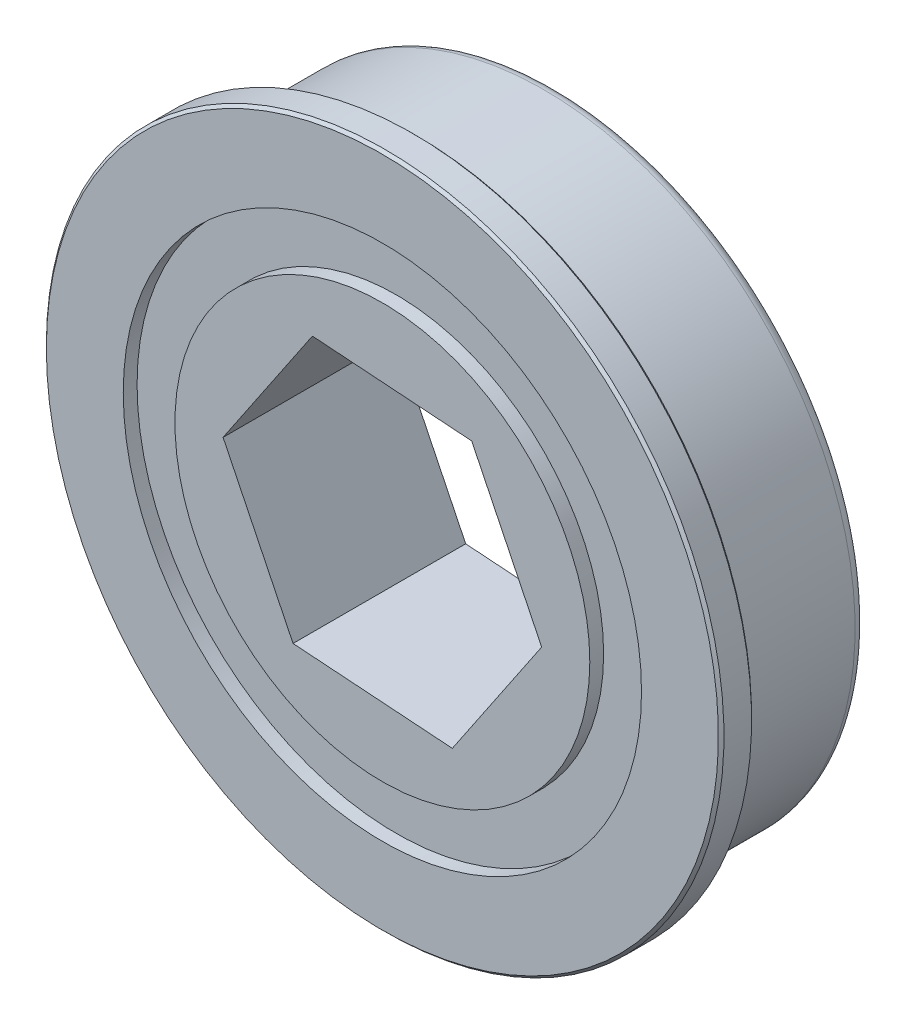
ISO-10303-21;
HEADER;
FILE_DESCRIPTION(('STEP AP214'),'2;1');
FILE_NAME('part.step','',(''),(''),'','','');
FILE_SCHEMA(('AUTOMOTIVE_DESIGN { 1 0 10303 214 1 1 1 1 }'));
ENDSEC;
DATA;
#1=APPLICATION_CONTEXT('core data for automotive mechanical design processes');
#2=APPLICATION_PROTOCOL_DEFINITION('international standard','automotive_design',2000,#1);
#3=PRODUCT_CONTEXT('',#1,'mechanical');
#4=PRODUCT('Part','Part','',(#3));
#5=PRODUCT_RELATED_PRODUCT_CATEGORY('part','',(#4));
#6=PRODUCT_DEFINITION_FORMATION('','',#4);
#7=PRODUCT_DEFINITION_CONTEXT('part definition',#1,'design');
#8=PRODUCT_DEFINITION('design','',#6,#7);
#9=PRODUCT_DEFINITION_SHAPE('','',#8);
#10=(LENGTH_UNIT() NAMED_UNIT(*) SI_UNIT(.MILLI.,.METRE.));
#11=(NAMED_UNIT(*) PLANE_ANGLE_UNIT() SI_UNIT($,.RADIAN.));
#12=(NAMED_UNIT(*) SI_UNIT($,.STERADIAN.) SOLID_ANGLE_UNIT());
#13=UNCERTAINTY_MEASURE_WITH_UNIT(LENGTH_MEASURE(1.E-05),#10,'distance_accuracy_value','');
#14=(GEOMETRIC_REPRESENTATION_CONTEXT(3) GLOBAL_UNCERTAINTY_ASSIGNED_CONTEXT((#13)) GLOBAL_UNIT_ASSIGNED_CONTEXT((#10,
#11,#12)) REPRESENTATION_CONTEXT('',''));
#15=CARTESIAN_POINT('',(0.,0.,0.));
#16=DIRECTION('',(0.,0.,1.));
#17=DIRECTION('',(1.,0.,0.));
#18=AXIS2_PLACEMENT_3D('',#15,#16,#17);
#19=CARTESIAN_POINT('',(0.,0.,-0.000999999999999265));
#20=DIRECTION('',(0.,0.,1.));
#21=DIRECTION('',(1.,0.,0.));
#22=AXIS2_PLACEMENT_3D('',#19,#20,#21);
#23=CYLINDRICAL_SURFACE('',#22,11.8991111578808);
#24=CARTESIAN_POINT('',(0.,0.,0.635));
#25=DIRECTION('',(0.,0.,-1.));
#26=DIRECTION('',(-1.,0.,0.));
#27=AXIS2_PLACEMENT_3D('',#24,#25,#26);
#28=CIRCLE('',#27,11.8991111578808);
#29=CARTESIAN_POINT('',(-11.8991111578808,0.,0.635));
#30=VERTEX_POINT('',#29);
#31=EDGE_CURVE('E127',#30,#30,#28,.T.);
#32=ORIENTED_EDGE('',*,*,#31,.F.);
#33=EDGE_LOOP('',(#32));
#34=FACE_BOUND('',#33,.T.);
#35=CARTESIAN_POINT('',(0.,0.,0.));
#36=DIRECTION('',(0.,0.,-1.));
#37=DIRECTION('',(-1.,0.,0.));
#38=AXIS2_PLACEMENT_3D('',#35,#36,#37);
#39=CIRCLE('',#38,11.8991111578808);
#40=CARTESIAN_POINT('',(-11.8991111578808,0.,0.));
#41=VERTEX_POINT('',#40);
#42=EDGE_CURVE('E130',#41,#41,#39,.F.);
#43=ORIENTED_EDGE('',*,*,#42,.F.);
#44=EDGE_LOOP('',(#43));
#45=FACE_BOUND('',#44,.T.);
#46=ADVANCED_FACE('F35',(#34,#45),#23,.F.);
#47=CARTESIAN_POINT('',(0.,0.,7.80034));
#48=DIRECTION('',(0.,0.,-1.));
#49=DIRECTION('',(-1.,0.,0.));
#50=AXIS2_PLACEMENT_3D('',#47,#48,#49);
#51=CONICAL_SURFACE('',#50,15.5575,0.785398163397442);
#52=CARTESIAN_POINT('',(0.,0.,7.92734));
#53=DIRECTION('',(0.,0.,-1.));
#54=DIRECTION('',(-1.,0.,0.));
#55=AXIS2_PLACEMENT_3D('',#52,#53,#54);
#56=CIRCLE('',#55,15.4305);
#57=CARTESIAN_POINT('',(-15.4305,0.,7.92734));
#58=VERTEX_POINT('',#57);
#59=EDGE_CURVE('E153',#58,#58,#56,.T.);
#60=ORIENTED_EDGE('',*,*,#59,.T.);
#61=EDGE_LOOP('',(#60));
#62=FACE_BOUND('',#61,.T.);
#63=CARTESIAN_POINT('',(0.,0.,7.80034));
#64=DIRECTION('',(0.,0.,-1.));
#65=DIRECTION('',(-1.,0.,0.));
#66=AXIS2_PLACEMENT_3D('',#63,#64,#65);
#67=CIRCLE('',#66,15.5575);
#68=CARTESIAN_POINT('',(-15.5575,0.,7.80034));
#69=VERTEX_POINT('',#68);
#70=EDGE_CURVE('E139',#69,#69,#67,.T.);
#71=ORIENTED_EDGE('',*,*,#70,.F.);
#72=EDGE_LOOP('',(#71));
#73=FACE_BOUND('',#72,.T.);
#74=ADVANCED_FACE('F181',(#62,#73),#51,.T.);
#75=CARTESIAN_POINT('',(15.4305,0.,7.92734));
#76=DIRECTION('',(0.,0.,1.));
#77=DIRECTION('',(1.,0.,0.));
#78=AXIS2_PLACEMENT_3D('',#75,#76,#77);
#79=PLANE('',#78);
#80=CARTESIAN_POINT('',(0.,0.,7.92734));
#81=DIRECTION('',(0.,0.,1.));
#82=DIRECTION('',(1.,0.,0.));
#83=AXIS2_PLACEMENT_3D('',#80,#81,#82);
#84=CIRCLE('',#83,11.8991111578808);
#85=CARTESIAN_POINT('',(11.8991111578808,0.,7.92734));
#86=VERTEX_POINT('',#85);
#87=EDGE_CURVE('E136',#86,#86,#84,.T.);
#88=ORIENTED_EDGE('',*,*,#87,.F.);
#89=EDGE_LOOP('',(#88));
#90=FACE_BOUND('',#89,.T.);
#91=ORIENTED_EDGE('',*,*,#59,.F.);
#92=EDGE_LOOP('',(#91));
#93=FACE_BOUND('',#92,.T.);
#94=ADVANCED_FACE('F186',(#90,#93),#79,.T.);
#95=CARTESIAN_POINT('',(0.,0.,0.));
#96=DIRECTION('',(0.,0.,-1.));
#97=DIRECTION('',(-1.,0.,0.));
#98=AXIS2_PLACEMENT_3D('',#95,#96,#97);
#99=PLANE('',#98);
#100=ORIENTED_EDGE('',*,*,#42,.T.);
#101=EDGE_LOOP('',(#100));
#102=FACE_BOUND('',#101,.T.);
#103=CARTESIAN_POINT('',(0.,0.,0.));
#104=DIRECTION('',(0.,0.,-1.));
#105=DIRECTION('',(-1.,0.,0.));
#106=AXIS2_PLACEMENT_3D('',#103,#104,#105);
#107=CIRCLE('',#106,13.7795);
#108=CARTESIAN_POINT('',(-13.7795,0.,0.));
#109=VERTEX_POINT('',#108);
#110=EDGE_CURVE('E43',#109,#109,#107,.T.);
#111=ORIENTED_EDGE('',*,*,#110,.T.);
#112=EDGE_LOOP('',(#111));
#113=FACE_BOUND('',#112,.T.);
#114=ADVANCED_FACE('F164',(#102,#113),#99,.T.);
#115=CARTESIAN_POINT('',(0.,0.,7.92734));
#116=DIRECTION('',(0.,0.,-1.));
#117=DIRECTION('',(-1.,0.,0.));
#118=AXIS2_PLACEMENT_3D('',#115,#116,#117);
#119=CYLINDRICAL_SURFACE('',#118,14.2875);
#120=CARTESIAN_POINT('',(0.,0.,0.508));
#121=DIRECTION('',(0.,0.,-1.));
#122=DIRECTION('',(-1.,0.,0.));
#123=AXIS2_PLACEMENT_3D('',#120,#121,#122);
#124=CIRCLE('',#123,14.2875);
#125=CARTESIAN_POINT('',(-14.2875,0.,0.508));
#126=VERTEX_POINT('',#125);
#127=EDGE_CURVE('E12',#126,#126,#124,.F.);
#128=ORIENTED_EDGE('',*,*,#127,.T.);
#129=EDGE_LOOP('',(#128));
#130=FACE_BOUND('',#129,.T.);
#131=CARTESIAN_POINT('',(0.,0.,5.89534));
#132=DIRECTION('',(0.,0.,-1.));
#133=DIRECTION('',(-1.,0.,0.));
#134=AXIS2_PLACEMENT_3D('',#131,#132,#133);
#135=CIRCLE('',#134,14.2875);
#136=CARTESIAN_POINT('',(-14.2875,0.,5.89534));
#137=VERTEX_POINT('',#136);
#138=EDGE_CURVE('E150',#137,#137,#135,.T.);
#139=ORIENTED_EDGE('',*,*,#138,.T.);
#140=EDGE_LOOP('',(#139));
#141=FACE_BOUND('',#140,.T.);
#142=ADVANCED_FACE('F209',(#130,#141),#119,.T.);
#143=CARTESIAN_POINT('',(14.2875,0.,5.89534));
#144=DIRECTION('',(0.,0.,1.));
#145=DIRECTION('',(1.,0.,0.));
#146=AXIS2_PLACEMENT_3D('',#143,#144,#145);
#147=PLANE('',#146);
#148=CARTESIAN_POINT('',(0.,0.,5.89534));
#149=DIRECTION('',(0.,0.,-1.));
#150=DIRECTION('',(-1.,0.,0.));
#151=AXIS2_PLACEMENT_3D('',#148,#149,#150);
#152=CIRCLE('',#151,13.97);
#153=CARTESIAN_POINT('',(-13.97,0.,5.89534));
#154=VERTEX_POINT('',#153);
#155=EDGE_CURVE('E147',#154,#154,#152,.T.);
#156=ORIENTED_EDGE('',*,*,#155,.T.);
#157=EDGE_LOOP('',(#156));
#158=FACE_BOUND('',#157,.T.);
#159=ORIENTED_EDGE('',*,*,#138,.F.);
#160=EDGE_LOOP('',(#159));
#161=FACE_BOUND('',#160,.T.);
#162=ADVANCED_FACE('F205',(#158,#161),#147,.T.);
#163=CARTESIAN_POINT('',(0.,0.,7.92734));
#164=DIRECTION('',(0.,0.,-1.));
#165=DIRECTION('',(-1.,0.,0.));
#166=AXIS2_PLACEMENT_3D('',#163,#164,#165);
#167=CYLINDRICAL_SURFACE('',#166,13.97);
#168=CARTESIAN_POINT('',(0.,0.,6.40333999999999));
#169=DIRECTION('',(0.,0.,-1.));
#170=DIRECTION('',(-1.,0.,0.));
#171=AXIS2_PLACEMENT_3D('',#168,#169,#170);
#172=CIRCLE('',#171,13.97);
#173=CARTESIAN_POINT('',(-13.97,0.,6.40333999999999));
#174=VERTEX_POINT('',#173);
#175=EDGE_CURVE('E144',#174,#174,#172,.T.);
#176=ORIENTED_EDGE('',*,*,#175,.T.);
#177=EDGE_LOOP('',(#176));
#178=FACE_BOUND('',#177,.T.);
#179=ORIENTED_EDGE('',*,*,#155,.F.);
#180=EDGE_LOOP('',(#179));
#181=FACE_BOUND('',#180,.T.);
#182=ADVANCED_FACE('F201',(#178,#181),#167,.T.);
#183=CARTESIAN_POINT('',(13.97,0.,6.40334));
#184=DIRECTION('',(0.,0.,-1.));
#185=DIRECTION('',(-1.,0.,0.));
#186=AXIS2_PLACEMENT_3D('',#183,#184,#185);
#187=PLANE('',#186);
#188=CARTESIAN_POINT('',(0.,0.,6.40334));
#189=DIRECTION('',(0.,0.,-1.));
#190=DIRECTION('',(-1.,0.,0.));
#191=AXIS2_PLACEMENT_3D('',#188,#189,#190);
#192=CIRCLE('',#191,15.4305);
#193=CARTESIAN_POINT('',(-15.4305,0.,6.40334));
#194=VERTEX_POINT('',#193);
#195=EDGE_CURVE('E156',#194,#194,#192,.T.);
#196=ORIENTED_EDGE('',*,*,#195,.T.);
#197=EDGE_LOOP('',(#196));
#198=FACE_BOUND('',#197,.T.);
#199=ORIENTED_EDGE('',*,*,#175,.F.);
#200=EDGE_LOOP('',(#199));
#201=FACE_BOUND('',#200,.T.);
#202=ADVANCED_FACE('F197',(#198,#201),#187,.T.);
#203=CARTESIAN_POINT('',(0.,0.,7.92734));
#204=DIRECTION('',(0.,0.,-1.));
#205=DIRECTION('',(-1.,0.,0.));
#206=AXIS2_PLACEMENT_3D('',#203,#204,#205);
#207=CYLINDRICAL_SURFACE('',#206,15.5575);
#208=CARTESIAN_POINT('',(0.,0.,6.53034000000001));
#209=DIRECTION('',(0.,0.,-1.));
#210=DIRECTION('',(-1.,0.,0.));
#211=AXIS2_PLACEMENT_3D('',#208,#209,#210);
#212=CIRCLE('',#211,15.5575);
#213=CARTESIAN_POINT('',(-15.5575,0.,6.53034000000001));
#214=VERTEX_POINT('',#213);
#215=EDGE_CURVE('E159',#214,#214,#212,.F.);
#216=ORIENTED_EDGE('',*,*,#215,.T.);
#217=EDGE_LOOP('',(#216));
#218=FACE_BOUND('',#217,.T.);
#219=ORIENTED_EDGE('',*,*,#70,.T.);
#220=EDGE_LOOP('',(#219));
#221=FACE_BOUND('',#220,.T.);
#222=ADVANCED_FACE('F177',(#218,#221),#207,.T.);
#223=CARTESIAN_POINT('',(0.,0.,6.40334));
#224=DIRECTION('',(0.,0.,1.));
#225=DIRECTION('',(1.,0.,0.));
#226=AXIS2_PLACEMENT_3D('',#223,#224,#225);
#227=CONICAL_SURFACE('',#226,15.4305,0.785398163397407);
#228=ORIENTED_EDGE('',*,*,#215,.F.);
#229=EDGE_LOOP('',(#228));
#230=FACE_BOUND('',#229,.T.);
#231=ORIENTED_EDGE('',*,*,#195,.F.);
#232=EDGE_LOOP('',(#231));
#233=FACE_BOUND('',#232,.T.);
#234=ADVANCED_FACE('F168',(#230,#233),#227,.T.);
#235=CARTESIAN_POINT('',(0.,0.,0.508));
#236=DIRECTION('',(0.,0.,-1.));
#237=DIRECTION('',(-1.,0.,0.));
#238=AXIS2_PLACEMENT_3D('',#235,#236,#237);
#239=TOROIDAL_SURFACE('',#238,13.7795,0.508);
#240=ORIENTED_EDGE('',*,*,#127,.F.);
#241=EDGE_LOOP('',(#240));
#242=FACE_BOUND('',#241,.T.);
#243=ORIENTED_EDGE('',*,*,#110,.F.);
#244=EDGE_LOOP('',(#243));
#245=FACE_BOUND('',#244,.T.);
#246=ADVANCED_FACE('F37',(#242,#245),#239,.T.);
#247=CARTESIAN_POINT('',(0.,0.,7.29234));
#248=DIRECTION('',(0.,0.,1.));
#249=DIRECTION('',(1.,0.,0.));
#250=AXIS2_PLACEMENT_3D('',#247,#248,#249);
#251=CIRCLE('',#250,11.8991111578808);
#252=CARTESIAN_POINT('',(11.8991111578808,0.,7.29234));
#253=VERTEX_POINT('',#252);
#254=EDGE_CURVE('E126',#253,#253,#251,.F.);
#255=ORIENTED_EDGE('',*,*,#254,.T.);
#256=EDGE_LOOP('',(#255));
#257=FACE_BOUND('',#256,.T.);
#258=ORIENTED_EDGE('',*,*,#87,.T.);
#259=EDGE_LOOP('',(#258));
#260=FACE_BOUND('',#259,.T.);
#261=ADVANCED_FACE('F167',(#257,#260),#23,.F.);
#262=CARTESIAN_POINT('',(0.,0.,0.635));
#263=DIRECTION('',(0.,0.,-1.));
#264=DIRECTION('',(-1.,0.,0.));
#265=AXIS2_PLACEMENT_3D('',#262,#263,#264);
#266=PLANE('',#265);
#267=CARTESIAN_POINT('',(0.,0.,0.635));
#268=DIRECTION('',(0.,0.,-1.));
#269=DIRECTION('',(-1.,0.,0.));
#270=AXIS2_PLACEMENT_3D('',#267,#268,#269);
#271=CIRCLE('',#270,9.525);
#272=CARTESIAN_POINT('',(-9.525,0.,0.635));
#273=VERTEX_POINT('',#272);
#274=EDGE_CURVE('E131',#273,#273,#271,.T.);
#275=ORIENTED_EDGE('',*,*,#274,.F.);
#276=EDGE_LOOP('',(#275));
#277=FACE_BOUND('',#276,.T.);
#278=ORIENTED_EDGE('',*,*,#31,.T.);
#279=EDGE_LOOP('',(#278));
#280=FACE_BOUND('',#279,.T.);
#281=ADVANCED_FACE('F174',(#277,#280),#266,.T.);
#282=CARTESIAN_POINT('',(15.4305,0.,7.29234));
#283=DIRECTION('',(0.,0.,1.));
#284=DIRECTION('',(1.,0.,0.));
#285=AXIS2_PLACEMENT_3D('',#282,#283,#284);
#286=PLANE('',#285);
#287=ORIENTED_EDGE('',*,*,#254,.F.);
#288=EDGE_LOOP('',(#287));
#289=FACE_BOUND('',#288,.T.);
#290=CARTESIAN_POINT('',(0.,0.,7.29234));
#291=DIRECTION('',(0.,0.,1.));
#292=DIRECTION('',(1.,0.,0.));
#293=AXIS2_PLACEMENT_3D('',#290,#291,#292);
#294=CIRCLE('',#293,9.525);
#295=CARTESIAN_POINT('',(9.525,0.,7.29234));
#296=VERTEX_POINT('',#295);
#297=EDGE_CURVE('E123',#296,#296,#294,.T.);
#298=ORIENTED_EDGE('',*,*,#297,.F.);
#299=EDGE_LOOP('',(#298));
#300=FACE_BOUND('',#299,.T.);
#301=ADVANCED_FACE('F193',(#289,#300),#286,.T.);
#302=CARTESIAN_POINT('',(0.,0.,34.8681083632075));
#303=DIRECTION('',(0.,0.,-1.));
#304=DIRECTION('',(-1.,0.,0.));
#305=AXIS2_PLACEMENT_3D('',#302,#303,#304);
#306=CYLINDRICAL_SURFACE('',#305,9.525);
#307=ORIENTED_EDGE('',*,*,#274,.T.);
#308=EDGE_LOOP('',(#307));
#309=FACE_BOUND('',#308,.T.);
#310=CARTESIAN_POINT('',(0.,0.,0.));
#311=DIRECTION('',(0.,0.,-1.));
#312=DIRECTION('',(-1.,0.,0.));
#313=AXIS2_PLACEMENT_3D('',#310,#311,#312);
#314=CIRCLE('',#313,9.525);
#315=CARTESIAN_POINT('',(-9.525,0.,0.));
#316=VERTEX_POINT('',#315);
#317=EDGE_CURVE('E399',#316,#316,#314,.T.);
#318=ORIENTED_EDGE('',*,*,#317,.F.);
#319=EDGE_LOOP('',(#318));
#320=FACE_BOUND('',#319,.T.);
#321=ADVANCED_FACE('F279',(#309,#320),#306,.T.);
#322=ORIENTED_EDGE('',*,*,#297,.T.);
#323=EDGE_LOOP('',(#322));
#324=FACE_BOUND('',#323,.T.);
#325=CARTESIAN_POINT('',(0.,0.,7.92734));
#326=DIRECTION('',(0.,0.,1.));
#327=DIRECTION('',(1.,0.,0.));
#328=AXIS2_PLACEMENT_3D('',#325,#326,#327);
#329=CIRCLE('',#328,9.525);
#330=CARTESIAN_POINT('',(9.525,0.,7.92734));
#331=VERTEX_POINT('',#330);
#332=EDGE_CURVE('E115',#331,#331,#329,.F.);
#333=ORIENTED_EDGE('',*,*,#332,.T.);
#334=EDGE_LOOP('',(#333));
#335=FACE_BOUND('',#334,.T.);
#336=ADVANCED_FACE('F285',(#324,#335),#306,.T.);
#337=CARTESIAN_POINT('',(7.31433054001112,-0.513714010705348,34.8681083632075));
#338=DIRECTION('',(0.828866647753209,-0.559446226408184,0.));
#339=DIRECTION('',(0.559446226408184,0.828866647753209,0.));
#340=AXIS2_PLACEMENT_3D('',#337,#338,#339);
#341=PLANE('',#340);
#342=DIRECTION('',(-0.559446226408184,-0.828866647753209,0.));
#343=VECTOR('',#342,1.);
#344=CARTESIAN_POINT('',(7.31433054001112,-0.513714010705348,7.92734));
#345=LINE('',#344,#343);
#346=CARTESIAN_POINT('',(7.31433054001112,-0.513714010705348,7.92734));
#347=VERTEX_POINT('',#346);
#348=CARTESIAN_POINT('',(3.21227588645474,-6.59125306467865,7.92734));
#349=VERTEX_POINT('',#348);
#350=EDGE_CURVE('E108',#347,#349,#345,.T.);
#351=ORIENTED_EDGE('',*,*,#350,.F.);
#352=DIRECTION('',(0.,0.,-1.));
#353=VECTOR('',#352,1.);
#354=CARTESIAN_POINT('',(7.31433054001112,-0.513714010705348,34.8681083632075));
#355=LINE('',#354,#353);
#356=CARTESIAN_POINT('',(7.31433054001112,-0.513714010705348,0.));
#357=VERTEX_POINT('',#356);
#358=EDGE_CURVE('E112',#347,#357,#355,.T.);
#359=ORIENTED_EDGE('',*,*,#358,.T.);
#360=DIRECTION('',(-0.559446226408184,-0.828866647753209,0.));
#361=VECTOR('',#360,1.);
#362=CARTESIAN_POINT('',(7.31433054001112,-0.513714010705348,0.));
#363=LINE('',#362,#361);
#364=CARTESIAN_POINT('',(3.21227588645474,-6.59125306467865,0.));
#365=VERTEX_POINT('',#364);
#366=EDGE_CURVE('E114',#357,#365,#363,.T.);
#367=ORIENTED_EDGE('',*,*,#366,.T.);
#368=DIRECTION('',(0.,0.,-1.));
#369=VECTOR('',#368,1.);
#370=CARTESIAN_POINT('',(3.21227588645474,-6.59125306467865,34.8681083632075));
#371=LINE('',#370,#369);
#372=EDGE_CURVE('E56',#349,#365,#371,.T.);
#373=ORIENTED_EDGE('',*,*,#372,.F.);
#374=EDGE_LOOP('',(#351,#359,#367,#373));
#375=FACE_BOUND('',#374,.T.);
#376=ADVANCED_FACE('F295',(#375),#341,.F.);
#377=CARTESIAN_POINT('',(4.10205465355639,6.0775390539733,34.8681083632075));
#378=DIRECTION('',(0.898927967997433,0.438096460099835,0.));
#379=DIRECTION('',(-0.438096460099835,0.898927967997433,0.));
#380=AXIS2_PLACEMENT_3D('',#377,#378,#379);
#381=PLANE('',#380);
#382=DIRECTION('',(0.438096460099835,-0.898927967997433,0.));
#383=VECTOR('',#382,1.);
#384=CARTESIAN_POINT('',(4.10205465355639,6.0775390539733,7.92734));
#385=LINE('',#384,#383);
#386=CARTESIAN_POINT('',(4.10205465355639,6.0775390539733,7.92734));
#387=VERTEX_POINT('',#386);
#388=EDGE_CURVE('E398',#387,#347,#385,.T.);
#389=ORIENTED_EDGE('',*,*,#388,.F.);
#390=DIRECTION('',(0.,0.,-1.));
#391=VECTOR('',#390,1.);
#392=CARTESIAN_POINT('',(4.10205465355639,6.0775390539733,34.8681083632075));
#393=LINE('',#392,#391);
#394=CARTESIAN_POINT('',(4.10205465355639,6.0775390539733,0.));
#395=VERTEX_POINT('',#394);
#396=EDGE_CURVE('E116',#387,#395,#393,.T.);
#397=ORIENTED_EDGE('',*,*,#396,.T.);
#398=DIRECTION('',(0.438096460099835,-0.898927967997433,0.));
#399=VECTOR('',#398,1.);
#400=CARTESIAN_POINT('',(4.10205465355639,6.0775390539733,0.));
#401=LINE('',#400,#399);
#402=EDGE_CURVE('E118',#395,#357,#401,.T.);
#403=ORIENTED_EDGE('',*,*,#402,.T.);
#404=ORIENTED_EDGE('',*,*,#358,.F.);
#405=EDGE_LOOP('',(#389,#397,#403,#404));
#406=FACE_BOUND('',#405,.T.);
#407=ADVANCED_FACE('F303',(#406),#381,.F.);
#408=CARTESIAN_POINT('',(-3.21227588645473,6.59125306467865,34.8681083632075));
#409=DIRECTION('',(0.0700613202442238,0.997542686508019,0.));
#410=DIRECTION('',(-0.997542686508019,0.0700613202442238,0.));
#411=AXIS2_PLACEMENT_3D('',#408,#409,#410);
#412=PLANE('',#411);
#413=DIRECTION('',(0.997542686508019,-0.0700613202442238,0.));
#414=VECTOR('',#413,1.);
#415=CARTESIAN_POINT('',(-3.21227588645473,6.59125306467865,7.92734));
#416=LINE('',#415,#414);
#417=CARTESIAN_POINT('',(-3.21227588645473,6.59125306467865,7.92734));
#418=VERTEX_POINT('',#417);
#419=EDGE_CURVE('E91',#418,#387,#416,.T.);
#420=ORIENTED_EDGE('',*,*,#419,.F.);
#421=DIRECTION('',(0.,0.,-1.));
#422=VECTOR('',#421,1.);
#423=CARTESIAN_POINT('',(-3.21227588645473,6.59125306467865,34.8681083632075));
#424=LINE('',#423,#422);
#425=CARTESIAN_POINT('',(-3.21227588645473,6.59125306467865,0.));
#426=VERTEX_POINT('',#425);
#427=EDGE_CURVE('E87',#418,#426,#424,.T.);
#428=ORIENTED_EDGE('',*,*,#427,.T.);
#429=DIRECTION('',(0.997542686508019,-0.0700613202442238,0.));
#430=VECTOR('',#429,1.);
#431=CARTESIAN_POINT('',(-3.21227588645473,6.59125306467865,0.));
#432=LINE('',#431,#430);
#433=EDGE_CURVE('E101',#426,#395,#432,.T.);
#434=ORIENTED_EDGE('',*,*,#433,.T.);
#435=ORIENTED_EDGE('',*,*,#396,.F.);
#436=EDGE_LOOP('',(#420,#428,#434,#435));
#437=FACE_BOUND('',#436,.T.);
#438=ADVANCED_FACE('F312',(#437),#412,.F.);
#439=CARTESIAN_POINT('',(-7.31433054001111,0.513714010705348,34.8681083632075));
#440=DIRECTION('',(-0.828866647753209,0.559446226408184,0.));
#441=DIRECTION('',(-0.559446226408184,-0.828866647753209,0.));
#442=AXIS2_PLACEMENT_3D('',#439,#440,#441);
#443=PLANE('',#442);
#444=DIRECTION('',(0.559446226408184,0.828866647753209,0.));
#445=VECTOR('',#444,1.);
#446=CARTESIAN_POINT('',(-7.31433054001111,0.513714010705348,7.92734));
#447=LINE('',#446,#445);
#448=CARTESIAN_POINT('',(-7.31433054001111,0.513714010705348,7.92734));
#449=VERTEX_POINT('',#448);
#450=EDGE_CURVE('E85',#449,#418,#447,.T.);
#451=ORIENTED_EDGE('',*,*,#450,.F.);
#452=DIRECTION('',(0.,0.,-1.));
#453=VECTOR('',#452,1.);
#454=CARTESIAN_POINT('',(-7.31433054001111,0.513714010705348,34.8681083632075));
#455=LINE('',#454,#453);
#456=CARTESIAN_POINT('',(-7.31433054001111,0.513714010705348,0.));
#457=VERTEX_POINT('',#456);
#458=EDGE_CURVE('E81',#449,#457,#455,.T.);
#459=ORIENTED_EDGE('',*,*,#458,.T.);
#460=DIRECTION('',(0.559446226408184,0.828866647753209,0.));
#461=VECTOR('',#460,1.);
#462=CARTESIAN_POINT('',(-7.31433054001111,0.513714010705348,0.));
#463=LINE('',#462,#461);
#464=EDGE_CURVE('E100',#457,#426,#463,.T.);
#465=ORIENTED_EDGE('',*,*,#464,.T.);
#466=ORIENTED_EDGE('',*,*,#427,.F.);
#467=EDGE_LOOP('',(#451,#459,#465,#466));
#468=FACE_BOUND('',#467,.T.);
#469=ADVANCED_FACE('F86',(#468),#443,.F.);
#470=CARTESIAN_POINT('',(-4.10205465355638,-6.0775390539733,34.8681083632075));
#471=DIRECTION('',(-0.898927967997433,-0.438096460099835,0.));
#472=DIRECTION('',(0.438096460099835,-0.898927967997433,0.));
#473=AXIS2_PLACEMENT_3D('',#470,#471,#472);
#474=PLANE('',#473);
#475=DIRECTION('',(-0.438096460099835,0.898927967997433,0.));
#476=VECTOR('',#475,1.);
#477=CARTESIAN_POINT('',(-4.10205465355638,-6.0775390539733,7.92734));
#478=LINE('',#477,#476);
#479=CARTESIAN_POINT('',(-4.10205465355638,-6.0775390539733,7.92734));
#480=VERTEX_POINT('',#479);
#481=EDGE_CURVE('E92',#480,#449,#478,.T.);
#482=ORIENTED_EDGE('',*,*,#481,.F.);
#483=DIRECTION('',(0.,0.,-1.));
#484=VECTOR('',#483,1.);
#485=CARTESIAN_POINT('',(-4.10205465355638,-6.0775390539733,34.8681083632075));
#486=LINE('',#485,#484);
#487=CARTESIAN_POINT('',(-4.10205465355638,-6.0775390539733,0.));
#488=VERTEX_POINT('',#487);
#489=EDGE_CURVE('E50',#480,#488,#486,.T.);
#490=ORIENTED_EDGE('',*,*,#489,.T.);
#491=DIRECTION('',(-0.438096460099835,0.898927967997433,0.));
#492=VECTOR('',#491,1.);
#493=CARTESIAN_POINT('',(-4.10205465355638,-6.0775390539733,0.));
#494=LINE('',#493,#492);
#495=EDGE_CURVE('E98',#488,#457,#494,.T.);
#496=ORIENTED_EDGE('',*,*,#495,.T.);
#497=ORIENTED_EDGE('',*,*,#458,.F.);
#498=EDGE_LOOP('',(#482,#490,#496,#497));
#499=FACE_BOUND('',#498,.T.);
#500=ADVANCED_FACE('F95',(#499),#474,.F.);
#501=CARTESIAN_POINT('',(3.21227588645474,-6.59125306467865,34.8681083632075));
#502=DIRECTION('',(-0.0700613202442235,-0.997542686508019,0.));
#503=DIRECTION('',(0.997542686508019,-0.0700613202442235,0.));
#504=AXIS2_PLACEMENT_3D('',#501,#502,#503);
#505=PLANE('',#504);
#506=DIRECTION('',(-0.997542686508019,0.0700613202442235,0.));
#507=VECTOR('',#506,1.);
#508=CARTESIAN_POINT('',(3.21227588645474,-6.59125306467865,7.92734));
#509=LINE('',#508,#507);
#510=EDGE_CURVE('E106',#349,#480,#509,.T.);
#511=ORIENTED_EDGE('',*,*,#510,.F.);
#512=ORIENTED_EDGE('',*,*,#372,.T.);
#513=DIRECTION('',(-0.997542686508019,0.0700613202442235,0.));
#514=VECTOR('',#513,1.);
#515=CARTESIAN_POINT('',(3.21227588645474,-6.59125306467865,0.));
#516=LINE('',#515,#514);
#517=EDGE_CURVE('E122',#365,#488,#516,.T.);
#518=ORIENTED_EDGE('',*,*,#517,.T.);
#519=ORIENTED_EDGE('',*,*,#489,.F.);
#520=EDGE_LOOP('',(#511,#512,#518,#519));
#521=FACE_BOUND('',#520,.T.);
#522=ADVANCED_FACE('F336',(#521),#505,.F.);
#523=CARTESIAN_POINT('',(0.,0.,0.));
#524=DIRECTION('',(0.,0.,-1.));
#525=DIRECTION('',(-1.,0.,0.));
#526=AXIS2_PLACEMENT_3D('',#523,#524,#525);
#527=PLANE('',#526);
#528=ORIENTED_EDGE('',*,*,#366,.F.);
#529=ORIENTED_EDGE('',*,*,#402,.F.);
#530=ORIENTED_EDGE('',*,*,#433,.F.);
#531=ORIENTED_EDGE('',*,*,#464,.F.);
#532=ORIENTED_EDGE('',*,*,#495,.F.);
#533=ORIENTED_EDGE('',*,*,#517,.F.);
#534=EDGE_LOOP('',(#528,#529,#530,#531,#532,#533));
#535=FACE_BOUND('',#534,.T.);
#536=ORIENTED_EDGE('',*,*,#317,.T.);
#537=EDGE_LOOP('',(#536));
#538=FACE_BOUND('',#537,.T.);
#539=ADVANCED_FACE('F344',(#535,#538),#527,.T.);
#540=CARTESIAN_POINT('',(15.4305,0.,7.92734));
#541=DIRECTION('',(0.,0.,1.));
#542=DIRECTION('',(1.,0.,0.));
#543=AXIS2_PLACEMENT_3D('',#540,#541,#542);
#544=PLANE('',#543);
#545=ORIENTED_EDGE('',*,*,#332,.F.);
#546=EDGE_LOOP('',(#545));
#547=FACE_BOUND('',#546,.T.);
#548=ORIENTED_EDGE('',*,*,#388,.T.);
#549=ORIENTED_EDGE('',*,*,#350,.T.);
#550=ORIENTED_EDGE('',*,*,#510,.T.);
#551=ORIENTED_EDGE('',*,*,#481,.T.);
#552=ORIENTED_EDGE('',*,*,#450,.T.);
#553=ORIENTED_EDGE('',*,*,#419,.T.);
#554=EDGE_LOOP('',(#548,#549,#550,#551,#552,#553));
#555=FACE_BOUND('',#554,.T.);
#556=ADVANCED_FACE('F104',(#547,#555),#544,.T.);
#557=CLOSED_SHELL('',(#46,#74,#94,#114,#142,#162,#182,#202,#222,#234,#246,#261,#281,#301,#321,
#336,#376,#407,#438,#469,#500,#522,#539,#556));
#558=MANIFOLD_SOLID_BREP('B2',#557);
#559=ADVANCED_BREP_SHAPE_REPRESENTATION('',(#18,#558),#14);
#560=SHAPE_DEFINITION_REPRESENTATION(#9,#559);
ENDSEC;
END-ISO-10303-21;
